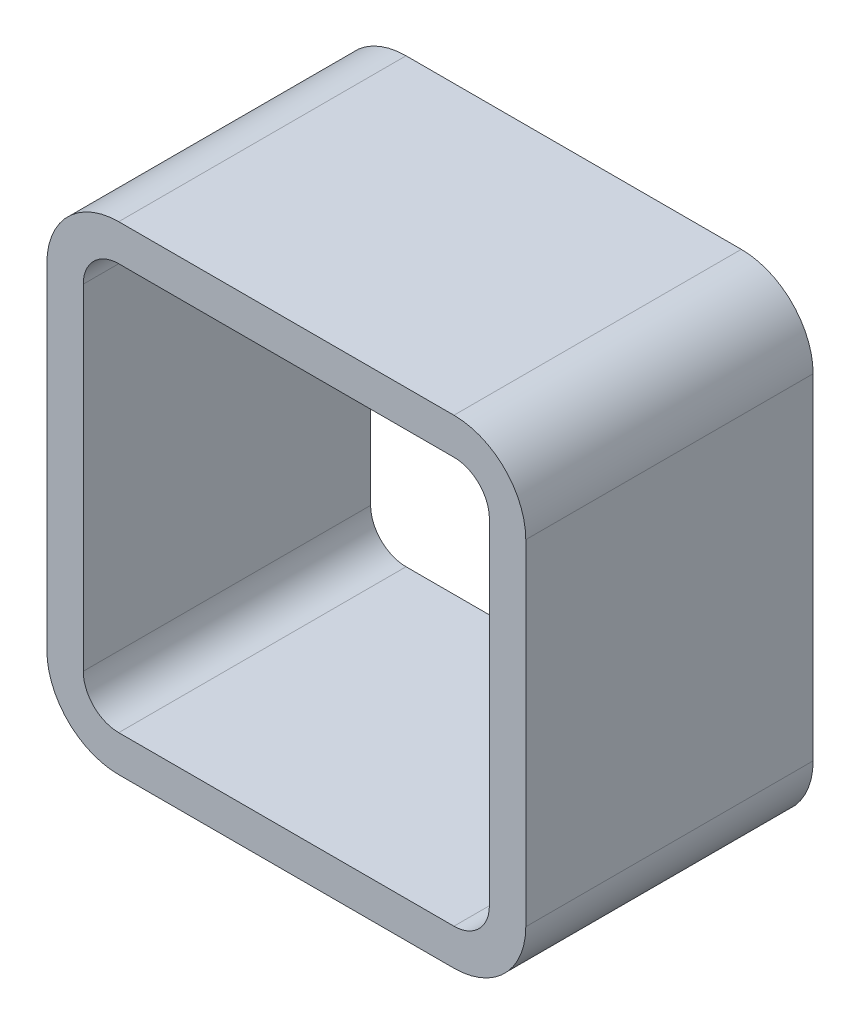
ISO-10303-21;
HEADER;
FILE_DESCRIPTION(('STEP AP214'),'2;1');
FILE_NAME('part.step','',(''),(''),'','','');
FILE_SCHEMA(('AUTOMOTIVE_DESIGN { 1 0 10303 214 1 1 1 1 }'));
ENDSEC;
DATA;
#1=APPLICATION_CONTEXT('core data for automotive mechanical design processes');
#2=APPLICATION_PROTOCOL_DEFINITION('international standard','automotive_design',2000,#1);
#3=PRODUCT_CONTEXT('',#1,'mechanical');
#4=PRODUCT('Part','Part','',(#3));
#5=PRODUCT_RELATED_PRODUCT_CATEGORY('part','',(#4));
#6=PRODUCT_DEFINITION_FORMATION('','',#4);
#7=PRODUCT_DEFINITION_CONTEXT('part definition',#1,'design');
#8=PRODUCT_DEFINITION('design','',#6,#7);
#9=PRODUCT_DEFINITION_SHAPE('','',#8);
#10=(LENGTH_UNIT() NAMED_UNIT(*) SI_UNIT(.MILLI.,.METRE.));
#11=(NAMED_UNIT(*) PLANE_ANGLE_UNIT() SI_UNIT($,.RADIAN.));
#12=(NAMED_UNIT(*) SI_UNIT($,.STERADIAN.) SOLID_ANGLE_UNIT());
#13=UNCERTAINTY_MEASURE_WITH_UNIT(LENGTH_MEASURE(1.E-05),#10,'distance_accuracy_value','');
#14=(GEOMETRIC_REPRESENTATION_CONTEXT(3) GLOBAL_UNCERTAINTY_ASSIGNED_CONTEXT((#13)) GLOBAL_UNIT_ASSIGNED_CONTEXT((#10,
#11,#12)) REPRESENTATION_CONTEXT('',''));
#15=CARTESIAN_POINT('',(0.,0.,0.));
#16=DIRECTION('',(0.,0.,1.));
#17=DIRECTION('',(1.,0.,0.));
#18=AXIS2_PLACEMENT_3D('',#15,#16,#17);
#19=CARTESIAN_POINT('',(-11.1125,11.1125,19.05));
#20=DIRECTION('',(0.,0.,-1.));
#21=DIRECTION('',(-1.,0.,0.));
#22=AXIS2_PLACEMENT_3D('',#19,#20,#21);
#23=PLANE('',#22);
#24=CARTESIAN_POINT('',(-11.1125,11.1125,19.05));
#25=DIRECTION('',(0.,0.,1.));
#26=DIRECTION('',(-1.,0.,0.));
#27=AXIS2_PLACEMENT_3D('',#24,#25,#26);
#28=CIRCLE('',#27,4.7625);
#29=CARTESIAN_POINT('',(-11.1125,15.875,19.05));
#30=VERTEX_POINT('',#29);
#31=CARTESIAN_POINT('',(-15.875,11.1125,19.05));
#32=VERTEX_POINT('',#31);
#33=EDGE_CURVE('E268',#30,#32,#28,.T.);
#34=ORIENTED_EDGE('',*,*,#33,.T.);
#35=DIRECTION('',(0.,-1.,0.));
#36=VECTOR('',#35,1.);
#37=CARTESIAN_POINT('',(-15.875,-11.1125,19.05));
#38=LINE('',#37,#36);
#39=CARTESIAN_POINT('',(-15.875,-11.1125,19.05));
#40=VERTEX_POINT('',#39);
#41=EDGE_CURVE('E272',#32,#40,#38,.T.);
#42=ORIENTED_EDGE('',*,*,#41,.T.);
#43=CARTESIAN_POINT('',(-11.1125,-11.1125,19.05));
#44=DIRECTION('',(0.,0.,1.));
#45=DIRECTION('',(-1.,0.,0.));
#46=AXIS2_PLACEMENT_3D('',#43,#44,#45);
#47=CIRCLE('',#46,4.7625);
#48=CARTESIAN_POINT('',(-11.1125,-15.875,19.05));
#49=VERTEX_POINT('',#48);
#50=EDGE_CURVE('E275',#40,#49,#47,.T.);
#51=ORIENTED_EDGE('',*,*,#50,.T.);
#52=DIRECTION('',(1.,0.,0.));
#53=VECTOR('',#52,1.);
#54=CARTESIAN_POINT('',(11.1125,-15.875,19.05));
#55=LINE('',#54,#53);
#56=CARTESIAN_POINT('',(11.1125,-15.875,19.05));
#57=VERTEX_POINT('',#56);
#58=EDGE_CURVE('E277',#49,#57,#55,.T.);
#59=ORIENTED_EDGE('',*,*,#58,.T.);
#60=CARTESIAN_POINT('',(11.1125,-11.1125,19.05));
#61=DIRECTION('',(0.,0.,1.));
#62=DIRECTION('',(-1.,0.,0.));
#63=AXIS2_PLACEMENT_3D('',#60,#61,#62);
#64=CIRCLE('',#63,4.76250000000001);
#65=CARTESIAN_POINT('',(15.875,-11.1125,19.05));
#66=VERTEX_POINT('',#65);
#67=EDGE_CURVE('E280',#57,#66,#64,.T.);
#68=ORIENTED_EDGE('',*,*,#67,.T.);
#69=DIRECTION('',(0.,1.,0.));
#70=VECTOR('',#69,1.);
#71=CARTESIAN_POINT('',(15.875,11.1125,19.05));
#72=LINE('',#71,#70);
#73=CARTESIAN_POINT('',(15.875,11.1125,19.05));
#74=VERTEX_POINT('',#73);
#75=EDGE_CURVE('E283',#66,#74,#72,.T.);
#76=ORIENTED_EDGE('',*,*,#75,.T.);
#77=CARTESIAN_POINT('',(11.1125,11.1125,19.05));
#78=DIRECTION('',(0.,0.,1.));
#79=DIRECTION('',(-1.,0.,0.));
#80=AXIS2_PLACEMENT_3D('',#77,#78,#79);
#81=CIRCLE('',#80,4.76250000000001);
#82=CARTESIAN_POINT('',(11.1125,15.875,19.05));
#83=VERTEX_POINT('',#82);
#84=EDGE_CURVE('E286',#74,#83,#81,.T.);
#85=ORIENTED_EDGE('',*,*,#84,.T.);
#86=DIRECTION('',(-1.,0.,0.));
#87=VECTOR('',#86,1.);
#88=CARTESIAN_POINT('',(-11.1125,15.875,19.05));
#89=LINE('',#88,#87);
#90=EDGE_CURVE('E289',#83,#30,#89,.T.);
#91=ORIENTED_EDGE('',*,*,#90,.T.);
#92=EDGE_LOOP('',(#34,#42,#51,#59,#68,#76,#85,#91));
#93=FACE_BOUND('',#92,.T.);
#94=CARTESIAN_POINT('',(-11.1125,11.1125,19.05));
#95=DIRECTION('',(0.,0.,1.));
#96=DIRECTION('',(-1.,0.,0.));
#97=AXIS2_PLACEMENT_3D('',#94,#95,#96);
#98=CIRCLE('',#97,2.34949999999999);
#99=CARTESIAN_POINT('',(-11.1125,13.462,19.05));
#100=VERTEX_POINT('',#99);
#101=CARTESIAN_POINT('',(-13.462,11.1125,19.05));
#102=VERTEX_POINT('',#101);
#103=EDGE_CURVE('E181',#100,#102,#98,.T.);
#104=ORIENTED_EDGE('',*,*,#103,.F.);
#105=DIRECTION('',(-1.,0.,0.));
#106=VECTOR('',#105,1.);
#107=CARTESIAN_POINT('',(-11.1125,13.462,19.05));
#108=LINE('',#107,#106);
#109=CARTESIAN_POINT('',(11.1125,13.462,19.05));
#110=VERTEX_POINT('',#109);
#111=EDGE_CURVE('E222',#110,#100,#108,.T.);
#112=ORIENTED_EDGE('',*,*,#111,.F.);
#113=CARTESIAN_POINT('',(11.1125,11.1125,19.05));
#114=DIRECTION('',(0.,0.,1.));
#115=DIRECTION('',(-1.,0.,0.));
#116=AXIS2_PLACEMENT_3D('',#113,#114,#115);
#117=CIRCLE('',#116,2.3495);
#118=CARTESIAN_POINT('',(13.462,11.1125,19.05));
#119=VERTEX_POINT('',#118);
#120=EDGE_CURVE('E219',#119,#110,#117,.T.);
#121=ORIENTED_EDGE('',*,*,#120,.F.);
#122=DIRECTION('',(0.,1.,0.));
#123=VECTOR('',#122,1.);
#124=CARTESIAN_POINT('',(13.462,11.1125,19.05));
#125=LINE('',#124,#123);
#126=CARTESIAN_POINT('',(13.462,-11.1125,19.05));
#127=VERTEX_POINT('',#126);
#128=EDGE_CURVE('E216',#127,#119,#125,.T.);
#129=ORIENTED_EDGE('',*,*,#128,.F.);
#130=CARTESIAN_POINT('',(11.1125,-11.1125,19.05));
#131=DIRECTION('',(0.,0.,1.));
#132=DIRECTION('',(-1.,0.,0.));
#133=AXIS2_PLACEMENT_3D('',#130,#131,#132);
#134=CIRCLE('',#133,2.3495);
#135=CARTESIAN_POINT('',(11.1125,-13.462,19.05));
#136=VERTEX_POINT('',#135);
#137=EDGE_CURVE('E213',#136,#127,#134,.T.);
#138=ORIENTED_EDGE('',*,*,#137,.F.);
#139=DIRECTION('',(1.,0.,0.));
#140=VECTOR('',#139,1.);
#141=CARTESIAN_POINT('',(11.1125,-13.462,19.05));
#142=LINE('',#141,#140);
#143=CARTESIAN_POINT('',(-11.1125,-13.462,19.05));
#144=VERTEX_POINT('',#143);
#145=EDGE_CURVE('E208',#144,#136,#142,.T.);
#146=ORIENTED_EDGE('',*,*,#145,.F.);
#147=CARTESIAN_POINT('',(-11.1125,-11.1125,19.05));
#148=DIRECTION('',(0.,0.,1.));
#149=DIRECTION('',(-1.,0.,0.));
#150=AXIS2_PLACEMENT_3D('',#147,#148,#149);
#151=CIRCLE('',#150,2.3495);
#152=CARTESIAN_POINT('',(-13.462,-11.1125,19.05));
#153=VERTEX_POINT('',#152);
#154=EDGE_CURVE('E204',#153,#144,#151,.T.);
#155=ORIENTED_EDGE('',*,*,#154,.F.);
#156=DIRECTION('',(0.,-1.,0.));
#157=VECTOR('',#156,1.);
#158=CARTESIAN_POINT('',(-13.462,-11.1125,19.05));
#159=LINE('',#158,#157);
#160=EDGE_CURVE('E190',#102,#153,#159,.T.);
#161=ORIENTED_EDGE('',*,*,#160,.F.);
#162=EDGE_LOOP('',(#104,#112,#121,#129,#138,#146,#155,#161));
#163=FACE_BOUND('',#162,.T.);
#164=ADVANCED_FACE('F40',(#93,#163),#23,.F.);
#165=CARTESIAN_POINT('',(-11.1125,11.1125,0.));
#166=DIRECTION('',(0.,0.,-1.));
#167=DIRECTION('',(-1.,0.,0.));
#168=AXIS2_PLACEMENT_3D('',#165,#166,#167);
#169=PLANE('',#168);
#170=CARTESIAN_POINT('',(-11.1125,11.1125,0.));
#171=DIRECTION('',(0.,0.,1.));
#172=DIRECTION('',(-1.,0.,0.));
#173=AXIS2_PLACEMENT_3D('',#170,#171,#172);
#174=CIRCLE('',#173,4.7625);
#175=CARTESIAN_POINT('',(-11.1125,15.875,0.));
#176=VERTEX_POINT('',#175);
#177=CARTESIAN_POINT('',(-15.875,11.1125,0.));
#178=VERTEX_POINT('',#177);
#179=EDGE_CURVE('E199',#176,#178,#174,.T.);
#180=ORIENTED_EDGE('',*,*,#179,.F.);
#181=DIRECTION('',(-1.,0.,0.));
#182=VECTOR('',#181,1.);
#183=CARTESIAN_POINT('',(-11.1125,15.875,0.));
#184=LINE('',#183,#182);
#185=CARTESIAN_POINT('',(11.1125,15.875,0.));
#186=VERTEX_POINT('',#185);
#187=EDGE_CURVE('E273',#186,#176,#184,.T.);
#188=ORIENTED_EDGE('',*,*,#187,.F.);
#189=CARTESIAN_POINT('',(11.1125,11.1125,0.));
#190=DIRECTION('',(0.,0.,1.));
#191=DIRECTION('',(-1.,0.,0.));
#192=AXIS2_PLACEMENT_3D('',#189,#190,#191);
#193=CIRCLE('',#192,4.76250000000001);
#194=CARTESIAN_POINT('',(15.875,11.1125,0.));
#195=VERTEX_POINT('',#194);
#196=EDGE_CURVE('E311',#195,#186,#193,.T.);
#197=ORIENTED_EDGE('',*,*,#196,.F.);
#198=DIRECTION('',(0.,1.,0.));
#199=VECTOR('',#198,1.);
#200=CARTESIAN_POINT('',(15.875,11.1125,0.));
#201=LINE('',#200,#199);
#202=CARTESIAN_POINT('',(15.875,-11.1125,0.));
#203=VERTEX_POINT('',#202);
#204=EDGE_CURVE('E308',#203,#195,#201,.T.);
#205=ORIENTED_EDGE('',*,*,#204,.F.);
#206=CARTESIAN_POINT('',(11.1125,-11.1125,0.));
#207=DIRECTION('',(0.,0.,1.));
#208=DIRECTION('',(-1.,0.,0.));
#209=AXIS2_PLACEMENT_3D('',#206,#207,#208);
#210=CIRCLE('',#209,4.76250000000001);
#211=CARTESIAN_POINT('',(11.1125,-15.875,0.));
#212=VERTEX_POINT('',#211);
#213=EDGE_CURVE('E305',#212,#203,#210,.T.);
#214=ORIENTED_EDGE('',*,*,#213,.F.);
#215=DIRECTION('',(1.,0.,0.));
#216=VECTOR('',#215,1.);
#217=CARTESIAN_POINT('',(11.1125,-15.875,0.));
#218=LINE('',#217,#216);
#219=CARTESIAN_POINT('',(-11.1125,-15.875,0.));
#220=VERTEX_POINT('',#219);
#221=EDGE_CURVE('E302',#220,#212,#218,.T.);
#222=ORIENTED_EDGE('',*,*,#221,.F.);
#223=CARTESIAN_POINT('',(-11.1125,-11.1125,0.));
#224=DIRECTION('',(0.,0.,1.));
#225=DIRECTION('',(-1.,0.,0.));
#226=AXIS2_PLACEMENT_3D('',#223,#224,#225);
#227=CIRCLE('',#226,4.7625);
#228=CARTESIAN_POINT('',(-15.875,-11.1125,0.));
#229=VERTEX_POINT('',#228);
#230=EDGE_CURVE('E299',#229,#220,#227,.T.);
#231=ORIENTED_EDGE('',*,*,#230,.F.);
#232=DIRECTION('',(0.,-1.,0.));
#233=VECTOR('',#232,1.);
#234=CARTESIAN_POINT('',(-15.875,-11.1125,0.));
#235=LINE('',#234,#233);
#236=EDGE_CURVE('E296',#178,#229,#235,.T.);
#237=ORIENTED_EDGE('',*,*,#236,.F.);
#238=EDGE_LOOP('',(#180,#188,#197,#205,#214,#222,#231,#237));
#239=FACE_BOUND('',#238,.T.);
#240=DIRECTION('',(-1.,0.,0.));
#241=VECTOR('',#240,1.);
#242=CARTESIAN_POINT('',(-11.1125,13.462,0.));
#243=LINE('',#242,#241);
#244=CARTESIAN_POINT('',(11.1125,13.462,0.));
#245=VERTEX_POINT('',#244);
#246=CARTESIAN_POINT('',(-11.1125,13.462,0.));
#247=VERTEX_POINT('',#246);
#248=EDGE_CURVE('E191',#245,#247,#243,.T.);
#249=ORIENTED_EDGE('',*,*,#248,.T.);
#250=CARTESIAN_POINT('',(-11.1125,11.1125,0.));
#251=DIRECTION('',(0.,0.,1.));
#252=DIRECTION('',(-1.,0.,0.));
#253=AXIS2_PLACEMENT_3D('',#250,#251,#252);
#254=CIRCLE('',#253,2.34949999999999);
#255=CARTESIAN_POINT('',(-13.462,11.1125,0.));
#256=VERTEX_POINT('',#255);
#257=EDGE_CURVE('E70',#247,#256,#254,.T.);
#258=ORIENTED_EDGE('',*,*,#257,.T.);
#259=DIRECTION('',(0.,-1.,0.));
#260=VECTOR('',#259,1.);
#261=CARTESIAN_POINT('',(-13.462,-11.1125,0.));
#262=LINE('',#261,#260);
#263=CARTESIAN_POINT('',(-13.462,-11.1125,0.));
#264=VERTEX_POINT('',#263);
#265=EDGE_CURVE('E197',#256,#264,#262,.T.);
#266=ORIENTED_EDGE('',*,*,#265,.T.);
#267=CARTESIAN_POINT('',(-11.1125,-11.1125,0.));
#268=DIRECTION('',(0.,0.,1.));
#269=DIRECTION('',(-1.,0.,0.));
#270=AXIS2_PLACEMENT_3D('',#267,#268,#269);
#271=CIRCLE('',#270,2.3495);
#272=CARTESIAN_POINT('',(-11.1125,-13.462,0.));
#273=VERTEX_POINT('',#272);
#274=EDGE_CURVE('E229',#264,#273,#271,.T.);
#275=ORIENTED_EDGE('',*,*,#274,.T.);
#276=DIRECTION('',(1.,0.,0.));
#277=VECTOR('',#276,1.);
#278=CARTESIAN_POINT('',(11.1125,-13.462,0.));
#279=LINE('',#278,#277);
#280=CARTESIAN_POINT('',(11.1125,-13.462,0.));
#281=VERTEX_POINT('',#280);
#282=EDGE_CURVE('E233',#273,#281,#279,.T.);
#283=ORIENTED_EDGE('',*,*,#282,.T.);
#284=CARTESIAN_POINT('',(11.1125,-11.1125,0.));
#285=DIRECTION('',(0.,0.,1.));
#286=DIRECTION('',(-1.,0.,0.));
#287=AXIS2_PLACEMENT_3D('',#284,#285,#286);
#288=CIRCLE('',#287,2.3495);
#289=CARTESIAN_POINT('',(13.462,-11.1125,0.));
#290=VERTEX_POINT('',#289);
#291=EDGE_CURVE('E237',#281,#290,#288,.T.);
#292=ORIENTED_EDGE('',*,*,#291,.T.);
#293=DIRECTION('',(0.,1.,0.));
#294=VECTOR('',#293,1.);
#295=CARTESIAN_POINT('',(13.462,11.1125,0.));
#296=LINE('',#295,#294);
#297=CARTESIAN_POINT('',(13.462,11.1125,0.));
#298=VERTEX_POINT('',#297);
#299=EDGE_CURVE('E241',#290,#298,#296,.T.);
#300=ORIENTED_EDGE('',*,*,#299,.T.);
#301=CARTESIAN_POINT('',(11.1125,11.1125,0.));
#302=DIRECTION('',(0.,0.,1.));
#303=DIRECTION('',(-1.,0.,0.));
#304=AXIS2_PLACEMENT_3D('',#301,#302,#303);
#305=CIRCLE('',#304,2.3495);
#306=EDGE_CURVE('E245',#298,#245,#305,.T.);
#307=ORIENTED_EDGE('',*,*,#306,.T.);
#308=EDGE_LOOP('',(#249,#258,#266,#275,#283,#292,#300,#307));
#309=FACE_BOUND('',#308,.T.);
#310=ADVANCED_FACE('F348',(#239,#309),#169,.T.);
#311=CARTESIAN_POINT('',(-11.1125,11.1125,19.05));
#312=DIRECTION('',(0.,0.,-1.));
#313=DIRECTION('',(-1.,0.,0.));
#314=AXIS2_PLACEMENT_3D('',#311,#312,#313);
#315=CYLINDRICAL_SURFACE('',#314,4.7625);
#316=ORIENTED_EDGE('',*,*,#179,.T.);
#317=DIRECTION('',(0.,0.,-1.));
#318=VECTOR('',#317,1.);
#319=CARTESIAN_POINT('',(-15.875,11.1125,19.05));
#320=LINE('',#319,#318);
#321=EDGE_CURVE('E11',#32,#178,#320,.T.);
#322=ORIENTED_EDGE('',*,*,#321,.F.);
#323=ORIENTED_EDGE('',*,*,#33,.F.);
#324=DIRECTION('',(0.,0.,-1.));
#325=VECTOR('',#324,1.);
#326=CARTESIAN_POINT('',(-11.1125,15.875,19.05));
#327=LINE('',#326,#325);
#328=EDGE_CURVE('E292',#30,#176,#327,.T.);
#329=ORIENTED_EDGE('',*,*,#328,.T.);
#330=EDGE_LOOP('',(#316,#322,#323,#329));
#331=FACE_BOUND('',#330,.T.);
#332=ADVANCED_FACE('F42',(#331),#315,.T.);
#333=CARTESIAN_POINT('',(-15.875,-11.1125,19.05));
#334=DIRECTION('',(1.,0.,0.));
#335=DIRECTION('',(0.,0.,-1.));
#336=AXIS2_PLACEMENT_3D('',#333,#334,#335);
#337=PLANE('',#336);
#338=ORIENTED_EDGE('',*,*,#236,.T.);
#339=DIRECTION('',(0.,0.,-1.));
#340=VECTOR('',#339,1.);
#341=CARTESIAN_POINT('',(-15.875,-11.1125,19.05));
#342=LINE('',#341,#340);
#343=EDGE_CURVE('E49',#40,#229,#342,.T.);
#344=ORIENTED_EDGE('',*,*,#343,.F.);
#345=ORIENTED_EDGE('',*,*,#41,.F.);
#346=ORIENTED_EDGE('',*,*,#321,.T.);
#347=EDGE_LOOP('',(#338,#344,#345,#346));
#348=FACE_BOUND('',#347,.T.);
#349=ADVANCED_FACE('F365',(#348),#337,.F.);
#350=CARTESIAN_POINT('',(-11.1125,-11.1125,19.05));
#351=DIRECTION('',(0.,0.,-1.));
#352=DIRECTION('',(-1.,0.,0.));
#353=AXIS2_PLACEMENT_3D('',#350,#351,#352);
#354=CYLINDRICAL_SURFACE('',#353,4.7625);
#355=ORIENTED_EDGE('',*,*,#230,.T.);
#356=DIRECTION('',(0.,0.,-1.));
#357=VECTOR('',#356,1.);
#358=CARTESIAN_POINT('',(-11.1125,-15.875,19.05));
#359=LINE('',#358,#357);
#360=EDGE_CURVE('E335',#49,#220,#359,.T.);
#361=ORIENTED_EDGE('',*,*,#360,.F.);
#362=ORIENTED_EDGE('',*,*,#50,.F.);
#363=ORIENTED_EDGE('',*,*,#343,.T.);
#364=EDGE_LOOP('',(#355,#361,#362,#363));
#365=FACE_BOUND('',#364,.T.);
#366=ADVANCED_FACE('F342',(#365),#354,.T.);
#367=CARTESIAN_POINT('',(11.1125,-15.875,19.05));
#368=DIRECTION('',(0.,1.,0.));
#369=DIRECTION('',(-1.,0.,0.));
#370=AXIS2_PLACEMENT_3D('',#367,#368,#369);
#371=PLANE('',#370);
#372=ORIENTED_EDGE('',*,*,#221,.T.);
#373=DIRECTION('',(0.,0.,-1.));
#374=VECTOR('',#373,1.);
#375=CARTESIAN_POINT('',(11.1125,-15.875,19.05));
#376=LINE('',#375,#374);
#377=EDGE_CURVE('E331',#57,#212,#376,.T.);
#378=ORIENTED_EDGE('',*,*,#377,.F.);
#379=ORIENTED_EDGE('',*,*,#58,.F.);
#380=ORIENTED_EDGE('',*,*,#360,.T.);
#381=EDGE_LOOP('',(#372,#378,#379,#380));
#382=FACE_BOUND('',#381,.T.);
#383=ADVANCED_FACE('F354',(#382),#371,.F.);
#384=CARTESIAN_POINT('',(11.1125,-11.1125,19.05));
#385=DIRECTION('',(0.,0.,-1.));
#386=DIRECTION('',(-1.,0.,0.));
#387=AXIS2_PLACEMENT_3D('',#384,#385,#386);
#388=CYLINDRICAL_SURFACE('',#387,4.76250000000001);
#389=ORIENTED_EDGE('',*,*,#213,.T.);
#390=DIRECTION('',(0.,0.,-1.));
#391=VECTOR('',#390,1.);
#392=CARTESIAN_POINT('',(15.875,-11.1125,19.05));
#393=LINE('',#392,#391);
#394=EDGE_CURVE('E327',#66,#203,#393,.T.);
#395=ORIENTED_EDGE('',*,*,#394,.F.);
#396=ORIENTED_EDGE('',*,*,#67,.F.);
#397=ORIENTED_EDGE('',*,*,#377,.T.);
#398=EDGE_LOOP('',(#389,#395,#396,#397));
#399=FACE_BOUND('',#398,.T.);
#400=ADVANCED_FACE('F358',(#399),#388,.T.);
#401=CARTESIAN_POINT('',(15.875,11.1125,19.05));
#402=DIRECTION('',(-1.,0.,0.));
#403=DIRECTION('',(0.,0.,1.));
#404=AXIS2_PLACEMENT_3D('',#401,#402,#403);
#405=PLANE('',#404);
#406=ORIENTED_EDGE('',*,*,#204,.T.);
#407=DIRECTION('',(0.,0.,-1.));
#408=VECTOR('',#407,1.);
#409=CARTESIAN_POINT('',(15.875,11.1125,19.05));
#410=LINE('',#409,#408);
#411=EDGE_CURVE('E323',#74,#195,#410,.T.);
#412=ORIENTED_EDGE('',*,*,#411,.F.);
#413=ORIENTED_EDGE('',*,*,#75,.F.);
#414=ORIENTED_EDGE('',*,*,#394,.T.);
#415=EDGE_LOOP('',(#406,#412,#413,#414));
#416=FACE_BOUND('',#415,.T.);
#417=ADVANCED_FACE('F378',(#416),#405,.F.);
#418=CARTESIAN_POINT('',(11.1125,11.1125,19.05));
#419=DIRECTION('',(0.,0.,-1.));
#420=DIRECTION('',(-1.,0.,0.));
#421=AXIS2_PLACEMENT_3D('',#418,#419,#420);
#422=CYLINDRICAL_SURFACE('',#421,4.76250000000001);
#423=ORIENTED_EDGE('',*,*,#196,.T.);
#424=DIRECTION('',(0.,0.,-1.));
#425=VECTOR('',#424,1.);
#426=CARTESIAN_POINT('',(11.1125,15.875,19.05));
#427=LINE('',#426,#425);
#428=EDGE_CURVE('E319',#83,#186,#427,.T.);
#429=ORIENTED_EDGE('',*,*,#428,.F.);
#430=ORIENTED_EDGE('',*,*,#84,.F.);
#431=ORIENTED_EDGE('',*,*,#411,.T.);
#432=EDGE_LOOP('',(#423,#429,#430,#431));
#433=FACE_BOUND('',#432,.T.);
#434=ADVANCED_FACE('F376',(#433),#422,.T.);
#435=CARTESIAN_POINT('',(-11.1125,15.875,19.05));
#436=DIRECTION('',(0.,-1.,0.));
#437=DIRECTION('',(1.,0.,0.));
#438=AXIS2_PLACEMENT_3D('',#435,#436,#437);
#439=PLANE('',#438);
#440=ORIENTED_EDGE('',*,*,#187,.T.);
#441=ORIENTED_EDGE('',*,*,#328,.F.);
#442=ORIENTED_EDGE('',*,*,#90,.F.);
#443=ORIENTED_EDGE('',*,*,#428,.T.);
#444=EDGE_LOOP('',(#440,#441,#442,#443));
#445=FACE_BOUND('',#444,.T.);
#446=ADVANCED_FACE('F371',(#445),#439,.F.);
#447=CARTESIAN_POINT('',(-11.1125,11.1125,19.05));
#448=DIRECTION('',(0.,0.,-1.));
#449=DIRECTION('',(-1.,0.,0.));
#450=AXIS2_PLACEMENT_3D('',#447,#448,#449);
#451=CYLINDRICAL_SURFACE('',#450,2.34949999999999);
#452=ORIENTED_EDGE('',*,*,#257,.F.);
#453=DIRECTION('',(0.,0.,-1.));
#454=VECTOR('',#453,1.);
#455=CARTESIAN_POINT('',(-11.1125,13.462,19.05));
#456=LINE('',#455,#454);
#457=EDGE_CURVE('E185',#100,#247,#456,.T.);
#458=ORIENTED_EDGE('',*,*,#457,.F.);
#459=ORIENTED_EDGE('',*,*,#103,.T.);
#460=DIRECTION('',(0.,0.,-1.));
#461=VECTOR('',#460,1.);
#462=CARTESIAN_POINT('',(-13.462,11.1125,19.05));
#463=LINE('',#462,#461);
#464=EDGE_CURVE('E184',#102,#256,#463,.T.);
#465=ORIENTED_EDGE('',*,*,#464,.T.);
#466=EDGE_LOOP('',(#452,#458,#459,#465));
#467=FACE_BOUND('',#466,.T.);
#468=ADVANCED_FACE('F183',(#467),#451,.F.);
#469=CARTESIAN_POINT('',(-13.462,-11.1125,19.05));
#470=DIRECTION('',(1.,0.,0.));
#471=DIRECTION('',(0.,1.,0.));
#472=AXIS2_PLACEMENT_3D('',#469,#470,#471);
#473=PLANE('',#472);
#474=ORIENTED_EDGE('',*,*,#265,.F.);
#475=ORIENTED_EDGE('',*,*,#464,.F.);
#476=ORIENTED_EDGE('',*,*,#160,.T.);
#477=DIRECTION('',(0.,0.,-1.));
#478=VECTOR('',#477,1.);
#479=CARTESIAN_POINT('',(-13.462,-11.1125,19.05));
#480=LINE('',#479,#478);
#481=EDGE_CURVE('E200',#153,#264,#480,.T.);
#482=ORIENTED_EDGE('',*,*,#481,.T.);
#483=EDGE_LOOP('',(#474,#475,#476,#482));
#484=FACE_BOUND('',#483,.T.);
#485=ADVANCED_FACE('F194',(#484),#473,.T.);
#486=CARTESIAN_POINT('',(-11.1125,-11.1125,19.05));
#487=DIRECTION('',(0.,0.,-1.));
#488=DIRECTION('',(-1.,0.,0.));
#489=AXIS2_PLACEMENT_3D('',#486,#487,#488);
#490=CYLINDRICAL_SURFACE('',#489,2.3495);
#491=ORIENTED_EDGE('',*,*,#274,.F.);
#492=ORIENTED_EDGE('',*,*,#481,.F.);
#493=ORIENTED_EDGE('',*,*,#154,.T.);
#494=DIRECTION('',(0.,0.,-1.));
#495=VECTOR('',#494,1.);
#496=CARTESIAN_POINT('',(-11.1125,-13.462,19.05));
#497=LINE('',#496,#495);
#498=EDGE_CURVE('E265',#144,#273,#497,.T.);
#499=ORIENTED_EDGE('',*,*,#498,.T.);
#500=EDGE_LOOP('',(#491,#492,#493,#499));
#501=FACE_BOUND('',#500,.T.);
#502=ADVANCED_FACE('F403',(#501),#490,.F.);
#503=CARTESIAN_POINT('',(11.1125,-13.462,19.05));
#504=DIRECTION('',(0.,1.,0.));
#505=DIRECTION('',(-1.,0.,0.));
#506=AXIS2_PLACEMENT_3D('',#503,#504,#505);
#507=PLANE('',#506);
#508=ORIENTED_EDGE('',*,*,#282,.F.);
#509=ORIENTED_EDGE('',*,*,#498,.F.);
#510=ORIENTED_EDGE('',*,*,#145,.T.);
#511=DIRECTION('',(0.,0.,-1.));
#512=VECTOR('',#511,1.);
#513=CARTESIAN_POINT('',(11.1125,-13.462,19.05));
#514=LINE('',#513,#512);
#515=EDGE_CURVE('E262',#136,#281,#514,.T.);
#516=ORIENTED_EDGE('',*,*,#515,.T.);
#517=EDGE_LOOP('',(#508,#509,#510,#516));
#518=FACE_BOUND('',#517,.T.);
#519=ADVANCED_FACE('F407',(#518),#507,.T.);
#520=CARTESIAN_POINT('',(11.1125,-11.1125,19.05));
#521=DIRECTION('',(0.,0.,-1.));
#522=DIRECTION('',(-1.,0.,0.));
#523=AXIS2_PLACEMENT_3D('',#520,#521,#522);
#524=CYLINDRICAL_SURFACE('',#523,2.3495);
#525=ORIENTED_EDGE('',*,*,#291,.F.);
#526=ORIENTED_EDGE('',*,*,#515,.F.);
#527=ORIENTED_EDGE('',*,*,#137,.T.);
#528=DIRECTION('',(0.,0.,-1.));
#529=VECTOR('',#528,1.);
#530=CARTESIAN_POINT('',(13.462,-11.1125,19.05));
#531=LINE('',#530,#529);
#532=EDGE_CURVE('E259',#127,#290,#531,.T.);
#533=ORIENTED_EDGE('',*,*,#532,.T.);
#534=EDGE_LOOP('',(#525,#526,#527,#533));
#535=FACE_BOUND('',#534,.T.);
#536=ADVANCED_FACE('F413',(#535),#524,.F.);
#537=CARTESIAN_POINT('',(13.462,11.1125,19.05));
#538=DIRECTION('',(-1.,0.,0.));
#539=DIRECTION('',(0.,-1.,0.));
#540=AXIS2_PLACEMENT_3D('',#537,#538,#539);
#541=PLANE('',#540);
#542=ORIENTED_EDGE('',*,*,#299,.F.);
#543=ORIENTED_EDGE('',*,*,#532,.F.);
#544=ORIENTED_EDGE('',*,*,#128,.T.);
#545=DIRECTION('',(0.,0.,-1.));
#546=VECTOR('',#545,1.);
#547=CARTESIAN_POINT('',(13.462,11.1125,19.05));
#548=LINE('',#547,#546);
#549=EDGE_CURVE('E256',#119,#298,#548,.T.);
#550=ORIENTED_EDGE('',*,*,#549,.T.);
#551=EDGE_LOOP('',(#542,#543,#544,#550));
#552=FACE_BOUND('',#551,.T.);
#553=ADVANCED_FACE('F417',(#552),#541,.T.);
#554=CARTESIAN_POINT('',(11.1125,11.1125,19.05));
#555=DIRECTION('',(0.,0.,-1.));
#556=DIRECTION('',(-1.,0.,0.));
#557=AXIS2_PLACEMENT_3D('',#554,#555,#556);
#558=CYLINDRICAL_SURFACE('',#557,2.3495);
#559=ORIENTED_EDGE('',*,*,#306,.F.);
#560=ORIENTED_EDGE('',*,*,#549,.F.);
#561=ORIENTED_EDGE('',*,*,#120,.T.);
#562=DIRECTION('',(0.,0.,-1.));
#563=VECTOR('',#562,1.);
#564=CARTESIAN_POINT('',(11.1125,13.462,19.05));
#565=LINE('',#564,#563);
#566=EDGE_CURVE('E59',#110,#245,#565,.T.);
#567=ORIENTED_EDGE('',*,*,#566,.T.);
#568=EDGE_LOOP('',(#559,#560,#561,#567));
#569=FACE_BOUND('',#568,.T.);
#570=ADVANCED_FACE('F421',(#569),#558,.F.);
#571=CARTESIAN_POINT('',(-11.1125,13.462,19.05));
#572=DIRECTION('',(0.,-1.,0.));
#573=DIRECTION('',(0.,0.,-1.));
#574=AXIS2_PLACEMENT_3D('',#571,#572,#573);
#575=PLANE('',#574);
#576=ORIENTED_EDGE('',*,*,#248,.F.);
#577=ORIENTED_EDGE('',*,*,#566,.F.);
#578=ORIENTED_EDGE('',*,*,#111,.T.);
#579=ORIENTED_EDGE('',*,*,#457,.T.);
#580=EDGE_LOOP('',(#576,#577,#578,#579));
#581=FACE_BOUND('',#580,.T.);
#582=ADVANCED_FACE('F425',(#581),#575,.T.);
#583=CLOSED_SHELL('',(#164,#310,#332,#349,#366,#383,#400,#417,#434,#446,#468,#485,#502,#519,
#536,#553,#570,#582));
#584=MANIFOLD_SOLID_BREP('B2',#583);
#585=ADVANCED_BREP_SHAPE_REPRESENTATION('',(#18,#584),#14);
#586=SHAPE_DEFINITION_REPRESENTATION(#9,#585);
ENDSEC;
END-ISO-10303-21;
